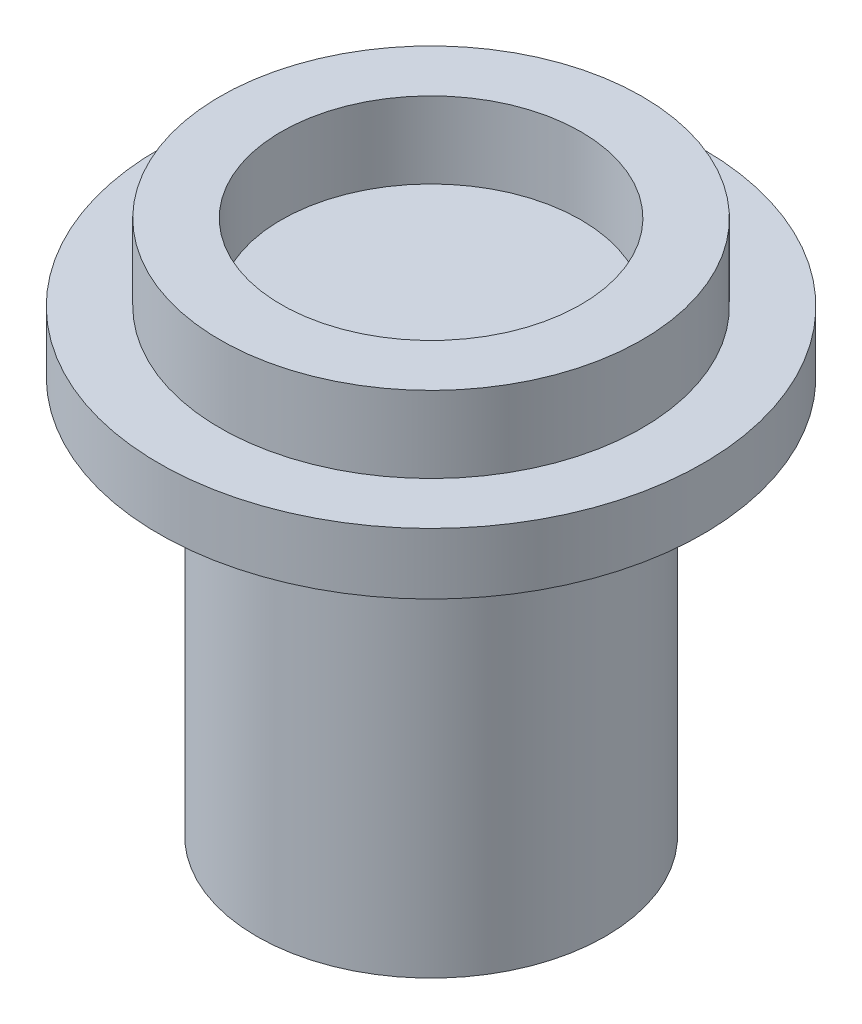
ISO-10303-21;
HEADER;
FILE_DESCRIPTION(('STEP AP214'),'2;1');
FILE_NAME('part.step','',(''),(''),'','','');
FILE_SCHEMA(('AUTOMOTIVE_DESIGN { 1 0 10303 214 1 1 1 1 }'));
ENDSEC;
DATA;
#1=APPLICATION_CONTEXT('core data for automotive mechanical design processes');
#2=APPLICATION_PROTOCOL_DEFINITION('international standard','automotive_design',2000,#1);
#3=PRODUCT_CONTEXT('',#1,'mechanical');
#4=PRODUCT('Part','Part','',(#3));
#5=PRODUCT_RELATED_PRODUCT_CATEGORY('part','',(#4));
#6=PRODUCT_DEFINITION_FORMATION('','',#4);
#7=PRODUCT_DEFINITION_CONTEXT('part definition',#1,'design');
#8=PRODUCT_DEFINITION('design','',#6,#7);
#9=PRODUCT_DEFINITION_SHAPE('','',#8);
#10=(LENGTH_UNIT() NAMED_UNIT(*) SI_UNIT(.MILLI.,.METRE.));
#11=(NAMED_UNIT(*) PLANE_ANGLE_UNIT() SI_UNIT($,.RADIAN.));
#12=(NAMED_UNIT(*) SI_UNIT($,.STERADIAN.) SOLID_ANGLE_UNIT());
#13=UNCERTAINTY_MEASURE_WITH_UNIT(LENGTH_MEASURE(1.E-05),#10,'distance_accuracy_value','');
#14=(GEOMETRIC_REPRESENTATION_CONTEXT(3) GLOBAL_UNCERTAINTY_ASSIGNED_CONTEXT((#13)) GLOBAL_UNIT_ASSIGNED_CONTEXT((#10,
#11,#12)) REPRESENTATION_CONTEXT('',''));
#15=CARTESIAN_POINT('',(0.,0.,0.));
#16=DIRECTION('',(0.,0.,1.));
#17=DIRECTION('',(1.,0.,0.));
#18=AXIS2_PLACEMENT_3D('',#15,#16,#17);
#19=CARTESIAN_POINT('',(1.55,1.1802967015182,0.));
#20=DIRECTION('',(0.,-1.,0.));
#21=DIRECTION('',(0.,0.,-1.));
#22=AXIS2_PLACEMENT_3D('',#19,#20,#21);
#23=PLANE('',#22);
#24=CARTESIAN_POINT('',(0.,1.1802967015182,0.));
#25=DIRECTION('',(0.,-1.,0.));
#26=DIRECTION('',(0.,0.,-1.));
#27=AXIS2_PLACEMENT_3D('',#24,#25,#26);
#28=CIRCLE('',#27,2.85);
#29=CARTESIAN_POINT('',(0.,1.1802967015182,-2.85));
#30=VERTEX_POINT('',#29);
#31=EDGE_CURVE('E10',#30,#30,#28,.T.);
#32=ORIENTED_EDGE('',*,*,#31,.T.);
#33=EDGE_LOOP('',(#32));
#34=FACE_BOUND('',#33,.T.);
#35=CARTESIAN_POINT('',(0.,1.1802967015182,0.));
#36=DIRECTION('',(0.,-1.,0.));
#37=DIRECTION('',(0.,0.,-1.));
#38=AXIS2_PLACEMENT_3D('',#35,#36,#37);
#39=CIRCLE('',#38,1.55);
#40=CARTESIAN_POINT('',(0.,1.1802967015182,-1.55));
#41=VERTEX_POINT('',#40);
#42=EDGE_CURVE('E69',#41,#41,#39,.T.);
#43=ORIENTED_EDGE('',*,*,#42,.F.);
#44=EDGE_LOOP('',(#43));
#45=FACE_BOUND('',#44,.T.);
#46=ADVANCED_FACE('F35',(#34,#45),#23,.T.);
#47=CARTESIAN_POINT('',(0.,-1.78837277536846,0.));
#48=DIRECTION('',(0.,-1.,0.));
#49=DIRECTION('',(0.,0.,-1.));
#50=AXIS2_PLACEMENT_3D('',#47,#48,#49);
#51=CYLINDRICAL_SURFACE('',#50,2.85);
#52=CARTESIAN_POINT('',(0.,7.68029670151819,0.));
#53=DIRECTION('',(0.,-1.,0.));
#54=DIRECTION('',(0.,0.,-1.));
#55=AXIS2_PLACEMENT_3D('',#52,#53,#54);
#56=CIRCLE('',#55,2.85);
#57=CARTESIAN_POINT('',(0.,7.68029670151819,-2.85));
#58=VERTEX_POINT('',#57);
#59=EDGE_CURVE('E41',#58,#58,#56,.T.);
#60=ORIENTED_EDGE('',*,*,#59,.T.);
#61=EDGE_LOOP('',(#60));
#62=FACE_BOUND('',#61,.T.);
#63=ORIENTED_EDGE('',*,*,#31,.F.);
#64=EDGE_LOOP('',(#63));
#65=FACE_BOUND('',#64,.T.);
#66=ADVANCED_FACE('F77',(#62,#65),#51,.T.);
#67=CARTESIAN_POINT('',(2.85,7.68029670151819,0.));
#68=DIRECTION('',(0.,-1.,0.));
#69=DIRECTION('',(0.,0.,-1.));
#70=AXIS2_PLACEMENT_3D('',#67,#68,#69);
#71=PLANE('',#70);
#72=CARTESIAN_POINT('',(0.,7.68029670151819,0.));
#73=DIRECTION('',(0.,-1.,0.));
#74=DIRECTION('',(0.,0.,-1.));
#75=AXIS2_PLACEMENT_3D('',#72,#73,#74);
#76=CIRCLE('',#75,4.45);
#77=CARTESIAN_POINT('',(0.,7.68029670151819,-4.45));
#78=VERTEX_POINT('',#77);
#79=EDGE_CURVE('E45',#78,#78,#76,.T.);
#80=ORIENTED_EDGE('',*,*,#79,.T.);
#81=EDGE_LOOP('',(#80));
#82=FACE_BOUND('',#81,.T.);
#83=ORIENTED_EDGE('',*,*,#59,.F.);
#84=EDGE_LOOP('',(#83));
#85=FACE_BOUND('',#84,.T.);
#86=ADVANCED_FACE('F81',(#82,#85),#71,.T.);
#87=CARTESIAN_POINT('',(0.,-1.78837277536846,0.));
#88=DIRECTION('',(0.,-1.,0.));
#89=DIRECTION('',(0.,0.,-1.));
#90=AXIS2_PLACEMENT_3D('',#87,#88,#89);
#91=CYLINDRICAL_SURFACE('',#90,4.45);
#92=CARTESIAN_POINT('',(0.,8.68029670151819,0.));
#93=DIRECTION('',(0.,-1.,0.));
#94=DIRECTION('',(0.,0.,-1.));
#95=AXIS2_PLACEMENT_3D('',#92,#93,#94);
#96=CIRCLE('',#95,4.45);
#97=CARTESIAN_POINT('',(0.,8.68029670151819,-4.45));
#98=VERTEX_POINT('',#97);
#99=EDGE_CURVE('E49',#98,#98,#96,.T.);
#100=ORIENTED_EDGE('',*,*,#99,.T.);
#101=EDGE_LOOP('',(#100));
#102=FACE_BOUND('',#101,.T.);
#103=ORIENTED_EDGE('',*,*,#79,.F.);
#104=EDGE_LOOP('',(#103));
#105=FACE_BOUND('',#104,.T.);
#106=ADVANCED_FACE('F85',(#102,#105),#91,.T.);
#107=CARTESIAN_POINT('',(4.45,8.68029670151819,0.));
#108=DIRECTION('',(0.,1.,0.));
#109=DIRECTION('',(0.,0.,1.));
#110=AXIS2_PLACEMENT_3D('',#107,#108,#109);
#111=PLANE('',#110);
#112=CARTESIAN_POINT('',(0.,8.68029670151819,0.));
#113=DIRECTION('',(0.,-1.,0.));
#114=DIRECTION('',(0.,0.,-1.));
#115=AXIS2_PLACEMENT_3D('',#112,#113,#114);
#116=CIRCLE('',#115,3.45);
#117=CARTESIAN_POINT('',(0.,8.68029670151819,-3.45));
#118=VERTEX_POINT('',#117);
#119=EDGE_CURVE('E54',#118,#118,#116,.T.);
#120=ORIENTED_EDGE('',*,*,#119,.T.);
#121=EDGE_LOOP('',(#120));
#122=FACE_BOUND('',#121,.T.);
#123=ORIENTED_EDGE('',*,*,#99,.F.);
#124=EDGE_LOOP('',(#123));
#125=FACE_BOUND('',#124,.T.);
#126=ADVANCED_FACE('F92',(#122,#125),#111,.T.);
#127=CARTESIAN_POINT('',(0.,-1.78837277536846,0.));
#128=DIRECTION('',(0.,-1.,0.));
#129=DIRECTION('',(0.,0.,-1.));
#130=AXIS2_PLACEMENT_3D('',#127,#128,#129);
#131=CYLINDRICAL_SURFACE('',#130,3.45);
#132=CARTESIAN_POINT('',(0.,9.92825941499908,0.));
#133=DIRECTION('',(0.,-1.,0.));
#134=DIRECTION('',(0.,0.,-1.));
#135=AXIS2_PLACEMENT_3D('',#132,#133,#134);
#136=CIRCLE('',#135,3.45);
#137=CARTESIAN_POINT('',(0.,9.92825941499908,-3.45));
#138=VERTEX_POINT('',#137);
#139=EDGE_CURVE('E57',#138,#138,#136,.T.);
#140=ORIENTED_EDGE('',*,*,#139,.T.);
#141=EDGE_LOOP('',(#140));
#142=FACE_BOUND('',#141,.T.);
#143=ORIENTED_EDGE('',*,*,#119,.F.);
#144=EDGE_LOOP('',(#143));
#145=FACE_BOUND('',#144,.T.);
#146=ADVANCED_FACE('F96',(#142,#145),#131,.T.);
#147=CARTESIAN_POINT('',(3.45,9.92825941499908,0.));
#148=DIRECTION('',(0.,1.,0.));
#149=DIRECTION('',(0.,0.,1.));
#150=AXIS2_PLACEMENT_3D('',#147,#148,#149);
#151=PLANE('',#150);
#152=CARTESIAN_POINT('',(0.,9.92825941499908,0.));
#153=DIRECTION('',(0.,-1.,0.));
#154=DIRECTION('',(0.,0.,-1.));
#155=AXIS2_PLACEMENT_3D('',#152,#153,#154);
#156=CIRCLE('',#155,2.45);
#157=CARTESIAN_POINT('',(0.,9.92825941499908,-2.45));
#158=VERTEX_POINT('',#157);
#159=EDGE_CURVE('E60',#158,#158,#156,.T.);
#160=ORIENTED_EDGE('',*,*,#159,.T.);
#161=EDGE_LOOP('',(#160));
#162=FACE_BOUND('',#161,.T.);
#163=ORIENTED_EDGE('',*,*,#139,.F.);
#164=EDGE_LOOP('',(#163));
#165=FACE_BOUND('',#164,.T.);
#166=ADVANCED_FACE('F100',(#162,#165),#151,.T.);
#167=CARTESIAN_POINT('',(0.,-1.78837277536846,0.));
#168=DIRECTION('',(0.,-1.,0.));
#169=DIRECTION('',(0.,0.,-1.));
#170=AXIS2_PLACEMENT_3D('',#167,#168,#169);
#171=CYLINDRICAL_SURFACE('',#170,2.45);
#172=CARTESIAN_POINT('',(0.,8.6802967015182,0.));
#173=DIRECTION('',(0.,-1.,0.));
#174=DIRECTION('',(0.,0.,-1.));
#175=AXIS2_PLACEMENT_3D('',#172,#173,#174);
#176=CIRCLE('',#175,2.45);
#177=CARTESIAN_POINT('',(0.,8.6802967015182,-2.45));
#178=VERTEX_POINT('',#177);
#179=EDGE_CURVE('E63',#178,#178,#176,.T.);
#180=ORIENTED_EDGE('',*,*,#179,.T.);
#181=EDGE_LOOP('',(#180));
#182=FACE_BOUND('',#181,.T.);
#183=ORIENTED_EDGE('',*,*,#159,.F.);
#184=EDGE_LOOP('',(#183));
#185=FACE_BOUND('',#184,.T.);
#186=ADVANCED_FACE('F104',(#182,#185),#171,.F.);
#187=CARTESIAN_POINT('',(2.45,8.6802967015182,0.));
#188=DIRECTION('',(0.,1.,0.));
#189=DIRECTION('',(0.,0.,1.));
#190=AXIS2_PLACEMENT_3D('',#187,#188,#189);
#191=PLANE('',#190);
#192=ORIENTED_EDGE('',*,*,#179,.F.);
#193=EDGE_LOOP('',(#192));
#194=FACE_BOUND('',#193,.T.);
#195=ADVANCED_FACE('F108',(#194),#191,.T.);
#196=CARTESIAN_POINT('',(1.55,7.6802967015182,0.));
#197=DIRECTION('',(0.,-1.,0.));
#198=DIRECTION('',(0.,0.,-1.));
#199=AXIS2_PLACEMENT_3D('',#196,#197,#198);
#200=PLANE('',#199);
#201=CARTESIAN_POINT('',(0.,7.6802967015182,0.));
#202=DIRECTION('',(0.,-1.,0.));
#203=DIRECTION('',(0.,0.,-1.));
#204=AXIS2_PLACEMENT_3D('',#201,#202,#203);
#205=CIRCLE('',#204,1.55);
#206=CARTESIAN_POINT('',(0.,7.6802967015182,-1.55));
#207=VERTEX_POINT('',#206);
#208=EDGE_CURVE('E66',#207,#207,#205,.T.);
#209=ORIENTED_EDGE('',*,*,#208,.T.);
#210=EDGE_LOOP('',(#209));
#211=FACE_BOUND('',#210,.T.);
#212=ADVANCED_FACE('F112',(#211),#200,.T.);
#213=CARTESIAN_POINT('',(0.,-1.78837277536846,0.));
#214=DIRECTION('',(0.,-1.,0.));
#215=DIRECTION('',(0.,0.,-1.));
#216=AXIS2_PLACEMENT_3D('',#213,#214,#215);
#217=CYLINDRICAL_SURFACE('',#216,1.55);
#218=ORIENTED_EDGE('',*,*,#42,.T.);
#219=EDGE_LOOP('',(#218));
#220=FACE_BOUND('',#219,.T.);
#221=ORIENTED_EDGE('',*,*,#208,.F.);
#222=EDGE_LOOP('',(#221));
#223=FACE_BOUND('',#222,.T.);
#224=ADVANCED_FACE('F73',(#220,#223),#217,.F.);
#225=CLOSED_SHELL('',(#46,#66,#86,#106,#126,#146,#166,#186,#195,#212,#224));
#226=MANIFOLD_SOLID_BREP('B2',#225);
#227=ADVANCED_BREP_SHAPE_REPRESENTATION('',(#18,#226),#14);
#228=SHAPE_DEFINITION_REPRESENTATION(#9,#227);
ENDSEC;
END-ISO-10303-21;
